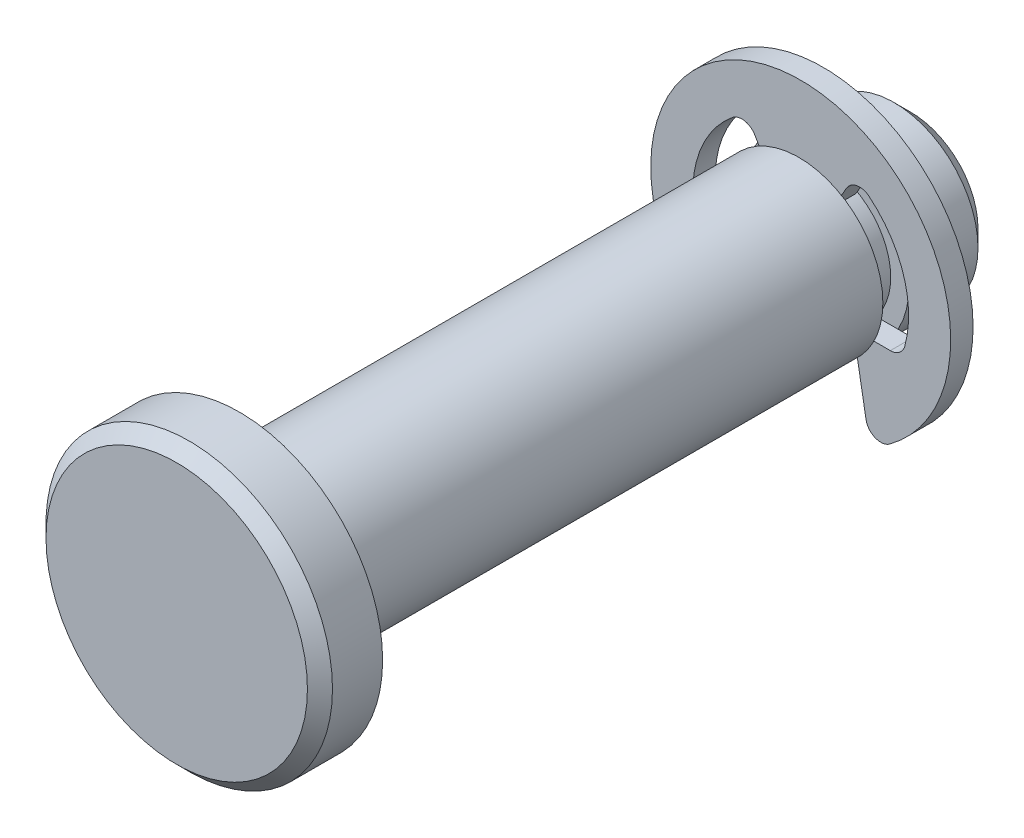
ISO-10303-21;
HEADER;
FILE_DESCRIPTION(('STEP AP214'),'2;1');
FILE_NAME('part.step','',(''),(''),'','','');
FILE_SCHEMA(('AUTOMOTIVE_DESIGN { 1 0 10303 214 1 1 1 1 }'));
ENDSEC;
DATA;
#1=APPLICATION_CONTEXT('core data for automotive mechanical design processes');
#2=APPLICATION_PROTOCOL_DEFINITION('international standard','automotive_design',2000,#1);
#3=PRODUCT_CONTEXT('',#1,'mechanical');
#4=PRODUCT('Part','Part','',(#3));
#5=PRODUCT_RELATED_PRODUCT_CATEGORY('part','',(#4));
#6=PRODUCT_DEFINITION_FORMATION('','',#4);
#7=PRODUCT_DEFINITION_CONTEXT('part definition',#1,'design');
#8=PRODUCT_DEFINITION('design','',#6,#7);
#9=PRODUCT_DEFINITION_SHAPE('','',#8);
#10=(LENGTH_UNIT() NAMED_UNIT(*) SI_UNIT(.MILLI.,.METRE.));
#11=(NAMED_UNIT(*) PLANE_ANGLE_UNIT() SI_UNIT($,.RADIAN.));
#12=(NAMED_UNIT(*) SI_UNIT($,.STERADIAN.) SOLID_ANGLE_UNIT());
#13=UNCERTAINTY_MEASURE_WITH_UNIT(LENGTH_MEASURE(1.E-05),#10,'distance_accuracy_value','');
#14=(GEOMETRIC_REPRESENTATION_CONTEXT(3) GLOBAL_UNCERTAINTY_ASSIGNED_CONTEXT((#13)) GLOBAL_UNIT_ASSIGNED_CONTEXT((#10,
#11,#12)) REPRESENTATION_CONTEXT('',''));
#15=CARTESIAN_POINT('',(0.,0.,0.));
#16=DIRECTION('',(0.,0.,1.));
#17=DIRECTION('',(1.,0.,0.));
#18=AXIS2_PLACEMENT_3D('',#15,#16,#17);
#19=CARTESIAN_POINT('',(0.,0.,-6.4008));
#20=DIRECTION('',(0.,0.,1.));
#21=DIRECTION('',(1.,0.,0.));
#22=AXIS2_PLACEMENT_3D('',#19,#20,#21);
#23=PLANE('',#22);
#24=DIRECTION('',(-0.173648177666931,0.984807753012208,0.));
#25=VECTOR('',#24,1.);
#26=CARTESIAN_POINT('',(1.25692963982568,0.22163060835344,-6.4008));
#27=LINE('',#26,#25);
#28=CARTESIAN_POINT('',(1.85256069501915,-3.15636096616503,-6.4008));
#29=VERTEX_POINT('',#28);
#30=CARTESIAN_POINT('',(1.49352,-1.12014,-6.4008));
#31=VERTEX_POINT('',#30);
#32=EDGE_CURVE('E202',#29,#31,#27,.T.);
#33=ORIENTED_EDGE('',*,*,#32,.F.);
#34=CARTESIAN_POINT('',(2.2715471535382,-3.08248234897663,-6.4008));
#35=DIRECTION('',(0.,0.,1.));
#36=DIRECTION('',(1.,0.,0.));
#37=AXIS2_PLACEMENT_3D('',#34,#35,#36);
#38=CIRCLE('',#37,0.42545);
#39=CARTESIAN_POINT('',(2.52394128170911,-3.42498038775182,-6.4008));
#40=VERTEX_POINT('',#39);
#41=EDGE_CURVE('E256',#29,#40,#38,.T.);
#42=ORIENTED_EDGE('',*,*,#41,.T.);
#43=CARTESIAN_POINT('',(0.,0.,-6.4008));
#44=DIRECTION('',(0.,0.,1.));
#45=DIRECTION('',(1.,0.,0.));
#46=AXIS2_PLACEMENT_3D('',#43,#44,#45);
#47=CIRCLE('',#46,4.2545);
#48=CARTESIAN_POINT('',(-2.52394128170911,-3.42498038775182,-6.4008));
#49=VERTEX_POINT('',#48);
#50=EDGE_CURVE('E182',#40,#49,#47,.T.);
#51=ORIENTED_EDGE('',*,*,#50,.T.);
#52=CARTESIAN_POINT('',(-2.2715471535382,-3.08248234897663,-6.4008));
#53=DIRECTION('',(0.,0.,1.));
#54=DIRECTION('',(1.,0.,0.));
#55=AXIS2_PLACEMENT_3D('',#52,#53,#54);
#56=CIRCLE('',#55,0.42545);
#57=CARTESIAN_POINT('',(-1.85256069501915,-3.15636096616503,-6.4008));
#58=VERTEX_POINT('',#57);
#59=EDGE_CURVE('E254',#49,#58,#56,.T.);
#60=ORIENTED_EDGE('',*,*,#59,.T.);
#61=DIRECTION('',(-0.173648177666931,-0.984807753012208,0.));
#62=VECTOR('',#61,1.);
#63=CARTESIAN_POINT('',(-1.25692963982568,0.22163060835344,-6.4008));
#64=LINE('',#63,#62);
#65=CARTESIAN_POINT('',(-1.49352,-1.12014,-6.4008));
#66=VERTEX_POINT('',#65);
#67=EDGE_CURVE('E198',#66,#58,#64,.T.);
#68=ORIENTED_EDGE('',*,*,#67,.F.);
#69=DIRECTION('',(1.,0.,0.));
#70=VECTOR('',#69,1.);
#71=CARTESIAN_POINT('',(0.,-1.12014,-6.4008));
#72=LINE('',#71,#70);
#73=CARTESIAN_POINT('',(-2.54203626378539,-1.12014,-6.4008));
#74=VERTEX_POINT('',#73);
#75=EDGE_CURVE('E189',#74,#66,#72,.T.);
#76=ORIENTED_EDGE('',*,*,#75,.F.);
#77=CARTESIAN_POINT('',(-2.54203626378539,-0.69469,-6.4008));
#78=DIRECTION('',(0.,0.,1.));
#79=DIRECTION('',(1.,0.,0.));
#80=AXIS2_PLACEMENT_3D('',#77,#78,#79);
#81=CIRCLE('',#80,0.42545);
#82=CARTESIAN_POINT('',(-2.95243729914352,-0.806844771084337,-6.4008));
#83=VERTEX_POINT('',#82);
#84=EDGE_CURVE('E54',#74,#83,#81,.F.);
#85=ORIENTED_EDGE('',*,*,#84,.T.);
#86=CARTESIAN_POINT('',(0.,0.,-6.4008));
#87=DIRECTION('',(0.,0.,1.));
#88=DIRECTION('',(1.,0.,0.));
#89=AXIS2_PLACEMENT_3D('',#86,#87,#88);
#90=CIRCLE('',#89,3.0607);
#91=CARTESIAN_POINT('',(-1.93820951958955,2.36880314677528,-6.4008));
#92=VERTEX_POINT('',#91);
#93=EDGE_CURVE('E214',#92,#83,#90,.T.);
#94=ORIENTED_EDGE('',*,*,#93,.F.);
#95=CARTESIAN_POINT('',(-1.66879035400345,2.03952968031481,-6.4008));
#96=DIRECTION('',(0.,0.,1.));
#97=DIRECTION('',(1.,0.,0.));
#98=AXIS2_PLACEMENT_3D('',#95,#96,#97);
#99=CIRCLE('',#98,0.42545);
#100=CARTESIAN_POINT('',(-1.30033984596336,2.25225468031482,-6.4008));
#101=VERTEX_POINT('',#100);
#102=EDGE_CURVE('E186',#92,#101,#99,.F.);
#103=ORIENTED_EDGE('',*,*,#102,.T.);
#104=DIRECTION('',(-0.500000000000002,0.866025403784438,0.));
#105=VECTOR('',#104,1.);
#106=CARTESIAN_POINT('',(0.,0.,-6.4008));
#107=LINE('',#106,#105);
#108=CARTESIAN_POINT('',(-0.933450000000003,1.61678282632517,-6.4008));
#109=VERTEX_POINT('',#108);
#110=EDGE_CURVE('E178',#109,#101,#107,.T.);
#111=ORIENTED_EDGE('',*,*,#110,.F.);
#112=DIRECTION('',(1.,0.,0.));
#113=VECTOR('',#112,1.);
#114=CARTESIAN_POINT('',(-0.933450000000003,1.61678282632517,-6.4008));
#115=LINE('',#114,#113);
#116=CARTESIAN_POINT('',(0.933450000000003,1.61678282632517,-6.4008));
#117=VERTEX_POINT('',#116);
#118=EDGE_CURVE('E162',#109,#117,#115,.T.);
#119=ORIENTED_EDGE('',*,*,#118,.T.);
#120=DIRECTION('',(-0.500000000000002,-0.866025403784438,0.));
#121=VECTOR('',#120,1.);
#122=CARTESIAN_POINT('',(0.,0.,-6.4008));
#123=LINE('',#122,#121);
#124=CARTESIAN_POINT('',(1.30033984596336,2.25225468031482,-6.4008));
#125=VERTEX_POINT('',#124);
#126=EDGE_CURVE('E212',#125,#117,#123,.T.);
#127=ORIENTED_EDGE('',*,*,#126,.F.);
#128=CARTESIAN_POINT('',(1.66879035400345,2.03952968031481,-6.4008));
#129=DIRECTION('',(0.,0.,1.));
#130=DIRECTION('',(1.,0.,0.));
#131=AXIS2_PLACEMENT_3D('',#128,#129,#130);
#132=CIRCLE('',#131,0.42545);
#133=CARTESIAN_POINT('',(1.93820951958955,2.36880314677528,-6.4008));
#134=VERTEX_POINT('',#133);
#135=EDGE_CURVE('E271',#125,#134,#132,.F.);
#136=ORIENTED_EDGE('',*,*,#135,.T.);
#137=CARTESIAN_POINT('',(0.,0.,-6.4008));
#138=DIRECTION('',(0.,0.,1.));
#139=DIRECTION('',(1.,0.,0.));
#140=AXIS2_PLACEMENT_3D('',#137,#138,#139);
#141=CIRCLE('',#140,3.0607);
#142=CARTESIAN_POINT('',(2.95243729914352,-0.806844771084337,-6.4008));
#143=VERTEX_POINT('',#142);
#144=EDGE_CURVE('E217',#143,#134,#141,.T.);
#145=ORIENTED_EDGE('',*,*,#144,.F.);
#146=CARTESIAN_POINT('',(2.54203626378539,-0.69469,-6.4008));
#147=DIRECTION('',(0.,0.,1.));
#148=DIRECTION('',(1.,0.,0.));
#149=AXIS2_PLACEMENT_3D('',#146,#147,#148);
#150=CIRCLE('',#149,0.42545);
#151=CARTESIAN_POINT('',(2.54203626378539,-1.12014,-6.4008));
#152=VERTEX_POINT('',#151);
#153=EDGE_CURVE('E267',#143,#152,#150,.F.);
#154=ORIENTED_EDGE('',*,*,#153,.T.);
#155=DIRECTION('',(1.,0.,0.));
#156=VECTOR('',#155,1.);
#157=CARTESIAN_POINT('',(0.,-1.12014,-6.4008));
#158=LINE('',#157,#156);
#159=EDGE_CURVE('E207',#31,#152,#158,.T.);
#160=ORIENTED_EDGE('',*,*,#159,.F.);
#161=EDGE_LOOP('',(#33,#42,#51,#60,#68,#76,#85,#94,#103,#111,#119,#127,#136,#145,#154,#160));
#162=FACE_BOUND('',#161,.T.);
#163=ADVANCED_FACE('F46',(#162),#23,.T.);
#164=CARTESIAN_POINT('',(0.,0.,-7.0358));
#165=DIRECTION('',(0.,0.,1.));
#166=DIRECTION('',(1.,0.,0.));
#167=AXIS2_PLACEMENT_3D('',#164,#165,#166);
#168=PLANE('',#167);
#169=CARTESIAN_POINT('',(0.,0.,-7.0358));
#170=DIRECTION('',(0.,0.,1.));
#171=DIRECTION('',(1.,0.,0.));
#172=AXIS2_PLACEMENT_3D('',#169,#170,#171);
#173=CIRCLE('',#172,4.2545);
#174=CARTESIAN_POINT('',(2.52394128170911,-3.42498038775182,-7.0358));
#175=VERTEX_POINT('',#174);
#176=CARTESIAN_POINT('',(-2.52394128170911,-3.42498038775182,-7.0358));
#177=VERTEX_POINT('',#176);
#178=EDGE_CURVE('E220',#175,#177,#173,.T.);
#179=ORIENTED_EDGE('',*,*,#178,.F.);
#180=CARTESIAN_POINT('',(2.2715471535382,-3.08248234897663,-7.0358));
#181=DIRECTION('',(0.,0.,1.));
#182=DIRECTION('',(1.,0.,0.));
#183=AXIS2_PLACEMENT_3D('',#180,#181,#182);
#184=CIRCLE('',#183,0.42545);
#185=CARTESIAN_POINT('',(1.85256069501915,-3.15636096616503,-7.0358));
#186=VERTEX_POINT('',#185);
#187=EDGE_CURVE('E264',#175,#186,#184,.F.);
#188=ORIENTED_EDGE('',*,*,#187,.T.);
#189=DIRECTION('',(-0.173648177666931,0.984807753012208,0.));
#190=VECTOR('',#189,1.);
#191=CARTESIAN_POINT('',(1.25692963982568,0.22163060835344,-7.0358));
#192=LINE('',#191,#190);
#193=CARTESIAN_POINT('',(1.49352,-1.12014,-7.0358));
#194=VERTEX_POINT('',#193);
#195=EDGE_CURVE('E200',#186,#194,#192,.T.);
#196=ORIENTED_EDGE('',*,*,#195,.T.);
#197=DIRECTION('',(1.,0.,0.));
#198=VECTOR('',#197,1.);
#199=CARTESIAN_POINT('',(0.,-1.12014,-7.0358));
#200=LINE('',#199,#198);
#201=CARTESIAN_POINT('',(2.54203626378539,-1.12014,-7.0358));
#202=VERTEX_POINT('',#201);
#203=EDGE_CURVE('E204',#194,#202,#200,.T.);
#204=ORIENTED_EDGE('',*,*,#203,.T.);
#205=CARTESIAN_POINT('',(2.54203626378539,-0.69469,-7.0358));
#206=DIRECTION('',(0.,0.,1.));
#207=DIRECTION('',(1.,0.,0.));
#208=AXIS2_PLACEMENT_3D('',#205,#206,#207);
#209=CIRCLE('',#208,0.42545);
#210=CARTESIAN_POINT('',(2.95243729914352,-0.806844771084337,-7.0358));
#211=VERTEX_POINT('',#210);
#212=EDGE_CURVE('E269',#202,#211,#209,.T.);
#213=ORIENTED_EDGE('',*,*,#212,.T.);
#214=CARTESIAN_POINT('',(0.,0.,-7.0358));
#215=DIRECTION('',(0.,0.,1.));
#216=DIRECTION('',(1.,0.,0.));
#217=AXIS2_PLACEMENT_3D('',#214,#215,#216);
#218=CIRCLE('',#217,3.0607);
#219=CARTESIAN_POINT('',(1.93820951958955,2.36880314677528,-7.0358));
#220=VERTEX_POINT('',#219);
#221=EDGE_CURVE('E228',#211,#220,#218,.T.);
#222=ORIENTED_EDGE('',*,*,#221,.T.);
#223=CARTESIAN_POINT('',(1.66879035400345,2.03952968031481,-7.0358));
#224=DIRECTION('',(0.,0.,1.));
#225=DIRECTION('',(1.,0.,0.));
#226=AXIS2_PLACEMENT_3D('',#223,#224,#225);
#227=CIRCLE('',#226,0.42545);
#228=CARTESIAN_POINT('',(1.30033984596336,2.25225468031482,-7.0358));
#229=VERTEX_POINT('',#228);
#230=EDGE_CURVE('E273',#220,#229,#227,.T.);
#231=ORIENTED_EDGE('',*,*,#230,.T.);
#232=DIRECTION('',(-0.500000000000002,-0.866025403784438,0.));
#233=VECTOR('',#232,1.);
#234=CARTESIAN_POINT('',(0.,0.,-7.0358));
#235=LINE('',#234,#233);
#236=CARTESIAN_POINT('',(0.933450000000003,1.61678282632517,-7.0358));
#237=VERTEX_POINT('',#236);
#238=EDGE_CURVE('E210',#229,#237,#235,.T.);
#239=ORIENTED_EDGE('',*,*,#238,.T.);
#240=DIRECTION('',(-1.,0.,0.));
#241=VECTOR('',#240,1.);
#242=CARTESIAN_POINT('',(-0.933450000000003,1.61678282632517,-7.0358));
#243=LINE('',#242,#241);
#244=CARTESIAN_POINT('',(-0.933450000000003,1.61678282632517,-7.0358));
#245=VERTEX_POINT('',#244);
#246=EDGE_CURVE('E173',#237,#245,#243,.T.);
#247=ORIENTED_EDGE('',*,*,#246,.T.);
#248=DIRECTION('',(-0.500000000000002,0.866025403784438,0.));
#249=VECTOR('',#248,1.);
#250=CARTESIAN_POINT('',(0.,0.,-7.0358));
#251=LINE('',#250,#249);
#252=CARTESIAN_POINT('',(-1.30033984596336,2.25225468031482,-7.0358));
#253=VERTEX_POINT('',#252);
#254=EDGE_CURVE('E181',#245,#253,#251,.T.);
#255=ORIENTED_EDGE('',*,*,#254,.T.);
#256=CARTESIAN_POINT('',(-1.66879035400345,2.03952968031481,-7.0358));
#257=DIRECTION('',(0.,0.,1.));
#258=DIRECTION('',(1.,0.,0.));
#259=AXIS2_PLACEMENT_3D('',#256,#257,#258);
#260=CIRCLE('',#259,0.42545);
#261=CARTESIAN_POINT('',(-1.93820951958955,2.36880314677528,-7.0358));
#262=VERTEX_POINT('',#261);
#263=EDGE_CURVE('E276',#253,#262,#260,.T.);
#264=ORIENTED_EDGE('',*,*,#263,.T.);
#265=CARTESIAN_POINT('',(0.,0.,-7.0358));
#266=DIRECTION('',(0.,0.,1.));
#267=DIRECTION('',(1.,0.,0.));
#268=AXIS2_PLACEMENT_3D('',#265,#266,#267);
#269=CIRCLE('',#268,3.0607);
#270=CARTESIAN_POINT('',(-2.95243729914352,-0.806844771084337,-7.0358));
#271=VERTEX_POINT('',#270);
#272=EDGE_CURVE('E225',#262,#271,#269,.T.);
#273=ORIENTED_EDGE('',*,*,#272,.T.);
#274=CARTESIAN_POINT('',(-2.54203626378539,-0.69469,-7.0358));
#275=DIRECTION('',(0.,0.,1.));
#276=DIRECTION('',(1.,0.,0.));
#277=AXIS2_PLACEMENT_3D('',#274,#275,#276);
#278=CIRCLE('',#277,0.42545);
#279=CARTESIAN_POINT('',(-2.54203626378539,-1.12014,-7.0358));
#280=VERTEX_POINT('',#279);
#281=EDGE_CURVE('E12',#271,#280,#278,.T.);
#282=ORIENTED_EDGE('',*,*,#281,.T.);
#283=DIRECTION('',(1.,0.,0.));
#284=VECTOR('',#283,1.);
#285=CARTESIAN_POINT('',(0.,-1.12014,-7.0358));
#286=LINE('',#285,#284);
#287=CARTESIAN_POINT('',(-1.49352,-1.12014,-7.0358));
#288=VERTEX_POINT('',#287);
#289=EDGE_CURVE('E187',#280,#288,#286,.T.);
#290=ORIENTED_EDGE('',*,*,#289,.T.);
#291=DIRECTION('',(-0.173648177666931,-0.984807753012208,0.));
#292=VECTOR('',#291,1.);
#293=CARTESIAN_POINT('',(-1.25692963982568,0.22163060835344,-7.0358));
#294=LINE('',#293,#292);
#295=CARTESIAN_POINT('',(-1.85256069501915,-3.15636096616503,-7.0358));
#296=VERTEX_POINT('',#295);
#297=EDGE_CURVE('E196',#288,#296,#294,.T.);
#298=ORIENTED_EDGE('',*,*,#297,.T.);
#299=CARTESIAN_POINT('',(-2.2715471535382,-3.08248234897663,-7.0358));
#300=DIRECTION('',(0.,0.,1.));
#301=DIRECTION('',(1.,0.,0.));
#302=AXIS2_PLACEMENT_3D('',#299,#300,#301);
#303=CIRCLE('',#302,0.42545);
#304=EDGE_CURVE('E68',#296,#177,#303,.F.);
#305=ORIENTED_EDGE('',*,*,#304,.T.);
#306=EDGE_LOOP('',(#179,#188,#196,#204,#213,#222,#231,#239,#247,#255,#264,#273,#282,#290,#298,#305));
#307=FACE_BOUND('',#306,.T.);
#308=ADVANCED_FACE('F289',(#307),#168,.F.);
#309=CARTESIAN_POINT('',(0.,0.,-6.4008));
#310=DIRECTION('',(0.,0.,-1.));
#311=DIRECTION('',(-1.,0.,0.));
#312=AXIS2_PLACEMENT_3D('',#309,#310,#311);
#313=CYLINDRICAL_SURFACE('',#312,4.2545);
#314=ORIENTED_EDGE('',*,*,#50,.F.);
#315=DIRECTION('',(0.,0.,-1.));
#316=VECTOR('',#315,1.);
#317=CARTESIAN_POINT('',(2.52394128170911,-3.42498038775182,-6.4008));
#318=LINE('',#317,#316);
#319=EDGE_CURVE('E261',#40,#175,#318,.T.);
#320=ORIENTED_EDGE('',*,*,#319,.T.);
#321=ORIENTED_EDGE('',*,*,#178,.T.);
#322=DIRECTION('',(0.,0.,-1.));
#323=VECTOR('',#322,1.);
#324=CARTESIAN_POINT('',(-2.52394128170911,-3.42498038775182,-6.4008));
#325=LINE('',#324,#323);
#326=EDGE_CURVE('E258',#177,#49,#325,.F.);
#327=ORIENTED_EDGE('',*,*,#326,.T.);
#328=EDGE_LOOP('',(#314,#320,#321,#327));
#329=FACE_BOUND('',#328,.T.);
#330=ADVANCED_FACE('F329',(#329),#313,.T.);
#331=CARTESIAN_POINT('',(-1.49352,-1.12014,-9.525));
#332=DIRECTION('',(-0.984807753012208,0.173648177666931,0.));
#333=DIRECTION('',(-0.173648177666931,-0.984807753012208,0.));
#334=AXIS2_PLACEMENT_3D('',#331,#332,#333);
#335=PLANE('',#334);
#336=ORIENTED_EDGE('',*,*,#67,.T.);
#337=DIRECTION('',(0.,0.,-1.));
#338=VECTOR('',#337,1.);
#339=CARTESIAN_POINT('',(-1.85256069501915,-3.15636096616503,-9.525));
#340=LINE('',#339,#338);
#341=EDGE_CURVE('E61',#58,#296,#340,.T.);
#342=ORIENTED_EDGE('',*,*,#341,.T.);
#343=ORIENTED_EDGE('',*,*,#297,.F.);
#344=DIRECTION('',(0.,0.,1.));
#345=VECTOR('',#344,1.);
#346=CARTESIAN_POINT('',(-1.49352,-1.12014,-9.525));
#347=LINE('',#346,#345);
#348=EDGE_CURVE('E294',#288,#66,#347,.T.);
#349=ORIENTED_EDGE('',*,*,#348,.T.);
#350=EDGE_LOOP('',(#336,#342,#343,#349));
#351=FACE_BOUND('',#350,.T.);
#352=ADVANCED_FACE('F334',(#351),#335,.F.);
#353=CARTESIAN_POINT('',(-1.53035,2.65064395336303,-9.525));
#354=DIRECTION('',(0.866025403784438,0.500000000000002,0.));
#355=DIRECTION('',(-0.500000000000002,0.866025403784438,0.));
#356=AXIS2_PLACEMENT_3D('',#353,#354,#355);
#357=PLANE('',#356);
#358=ORIENTED_EDGE('',*,*,#110,.T.);
#359=DIRECTION('',(0.,0.,-1.));
#360=VECTOR('',#359,1.);
#361=CARTESIAN_POINT('',(-1.30033984596336,2.25225468031481,-7.03580000000001));
#362=LINE('',#361,#360);
#363=EDGE_CURVE('E246',#101,#253,#362,.T.);
#364=ORIENTED_EDGE('',*,*,#363,.T.);
#365=ORIENTED_EDGE('',*,*,#254,.F.);
#366=DIRECTION('',(0.,0.,-1.));
#367=VECTOR('',#366,1.);
#368=CARTESIAN_POINT('',(-0.933450000000003,1.61678282632517,-6.4008));
#369=LINE('',#368,#367);
#370=EDGE_CURVE('E166',#245,#109,#369,.F.);
#371=ORIENTED_EDGE('',*,*,#370,.T.);
#372=EDGE_LOOP('',(#358,#364,#365,#371));
#373=FACE_BOUND('',#372,.T.);
#374=ADVANCED_FACE('F177',(#373),#357,.F.);
#375=CARTESIAN_POINT('',(0.,0.,-9.525));
#376=DIRECTION('',(0.,0.,1.));
#377=DIRECTION('',(1.,0.,0.));
#378=AXIS2_PLACEMENT_3D('',#375,#376,#377);
#379=CYLINDRICAL_SURFACE('',#378,3.0607);
#380=ORIENTED_EDGE('',*,*,#272,.F.);
#381=DIRECTION('',(0.,0.,1.));
#382=VECTOR('',#381,1.);
#383=CARTESIAN_POINT('',(-1.93820951958955,2.36880314677528,-9.525));
#384=LINE('',#383,#382);
#385=EDGE_CURVE('E243',#262,#92,#384,.T.);
#386=ORIENTED_EDGE('',*,*,#385,.T.);
#387=ORIENTED_EDGE('',*,*,#93,.T.);
#388=DIRECTION('',(0.,0.,1.));
#389=VECTOR('',#388,1.);
#390=CARTESIAN_POINT('',(-2.95243729914352,-0.806844771084337,-9.525));
#391=LINE('',#390,#389);
#392=EDGE_CURVE('E241',#83,#271,#391,.F.);
#393=ORIENTED_EDGE('',*,*,#392,.T.);
#394=EDGE_LOOP('',(#380,#386,#387,#393));
#395=FACE_BOUND('',#394,.T.);
#396=ADVANCED_FACE('F284',(#395),#379,.F.);
#397=CARTESIAN_POINT('',(-2.84836284036989,-1.12014,-9.525));
#398=DIRECTION('',(0.,-1.,0.));
#399=DIRECTION('',(0.,0.,-1.));
#400=AXIS2_PLACEMENT_3D('',#397,#398,#399);
#401=PLANE('',#400);
#402=ORIENTED_EDGE('',*,*,#289,.F.);
#403=DIRECTION('',(0.,0.,-1.));
#404=VECTOR('',#403,1.);
#405=CARTESIAN_POINT('',(-2.54203626378539,-1.12014,-6.4008));
#406=LINE('',#405,#404);
#407=EDGE_CURVE('E248',#280,#74,#406,.F.);
#408=ORIENTED_EDGE('',*,*,#407,.T.);
#409=ORIENTED_EDGE('',*,*,#75,.T.);
#410=ORIENTED_EDGE('',*,*,#348,.F.);
#411=EDGE_LOOP('',(#402,#408,#409,#410));
#412=FACE_BOUND('',#411,.T.);
#413=ADVANCED_FACE('F292',(#412),#401,.F.);
#414=CARTESIAN_POINT('',(0.,0.,-9.525));
#415=DIRECTION('',(0.,0.,1.));
#416=DIRECTION('',(1.,0.,0.));
#417=AXIS2_PLACEMENT_3D('',#414,#415,#416);
#418=CYLINDRICAL_SURFACE('',#417,3.0607);
#419=ORIENTED_EDGE('',*,*,#221,.F.);
#420=DIRECTION('',(0.,0.,1.));
#421=VECTOR('',#420,1.);
#422=CARTESIAN_POINT('',(2.95243729914352,-0.806844771084337,-9.525));
#423=LINE('',#422,#421);
#424=EDGE_CURVE('E233',#211,#143,#423,.T.);
#425=ORIENTED_EDGE('',*,*,#424,.T.);
#426=ORIENTED_EDGE('',*,*,#144,.T.);
#427=DIRECTION('',(0.,0.,1.));
#428=VECTOR('',#427,1.);
#429=CARTESIAN_POINT('',(1.93820951958955,2.36880314677528,-9.525));
#430=LINE('',#429,#428);
#431=EDGE_CURVE('E231',#134,#220,#430,.F.);
#432=ORIENTED_EDGE('',*,*,#431,.T.);
#433=EDGE_LOOP('',(#419,#425,#426,#432));
#434=FACE_BOUND('',#433,.T.);
#435=ADVANCED_FACE('F308',(#434),#418,.F.);
#436=CARTESIAN_POINT('',(1.49352,-1.12014,-9.525));
#437=DIRECTION('',(0.,-1.,0.));
#438=DIRECTION('',(0.,0.,-1.));
#439=AXIS2_PLACEMENT_3D('',#436,#437,#438);
#440=PLANE('',#439);
#441=ORIENTED_EDGE('',*,*,#159,.T.);
#442=DIRECTION('',(0.,0.,-1.));
#443=VECTOR('',#442,1.);
#444=CARTESIAN_POINT('',(2.54203626378539,-1.12014,-7.03580000000001));
#445=LINE('',#444,#443);
#446=EDGE_CURVE('E236',#152,#202,#445,.T.);
#447=ORIENTED_EDGE('',*,*,#446,.T.);
#448=ORIENTED_EDGE('',*,*,#203,.F.);
#449=DIRECTION('',(0.,0.,1.));
#450=VECTOR('',#449,1.);
#451=CARTESIAN_POINT('',(1.49352,-1.12014,-9.525));
#452=LINE('',#451,#450);
#453=EDGE_CURVE('E191',#194,#31,#452,.T.);
#454=ORIENTED_EDGE('',*,*,#453,.T.);
#455=EDGE_LOOP('',(#441,#447,#448,#454));
#456=FACE_BOUND('',#455,.T.);
#457=ADVANCED_FACE('F318',(#456),#440,.F.);
#458=CARTESIAN_POINT('',(1.49352,-1.12014,-9.525));
#459=DIRECTION('',(0.984807753012208,0.173648177666931,0.));
#460=DIRECTION('',(-0.173648177666931,0.984807753012208,0.));
#461=AXIS2_PLACEMENT_3D('',#458,#459,#460);
#462=PLANE('',#461);
#463=ORIENTED_EDGE('',*,*,#195,.F.);
#464=DIRECTION('',(0.,0.,-1.));
#465=VECTOR('',#464,1.);
#466=CARTESIAN_POINT('',(1.85256069501915,-3.15636096616503,-9.525));
#467=LINE('',#466,#465);
#468=EDGE_CURVE('E251',#186,#29,#467,.F.);
#469=ORIENTED_EDGE('',*,*,#468,.T.);
#470=ORIENTED_EDGE('',*,*,#32,.T.);
#471=ORIENTED_EDGE('',*,*,#453,.F.);
#472=EDGE_LOOP('',(#463,#469,#470,#471));
#473=FACE_BOUND('',#472,.T.);
#474=ADVANCED_FACE('F323',(#473),#462,.F.);
#475=CARTESIAN_POINT('',(0.,0.,-9.525));
#476=DIRECTION('',(-0.866025403784438,0.500000000000002,0.));
#477=DIRECTION('',(-0.500000000000002,-0.866025403784438,0.));
#478=AXIS2_PLACEMENT_3D('',#475,#476,#477);
#479=PLANE('',#478);
#480=ORIENTED_EDGE('',*,*,#238,.F.);
#481=DIRECTION('',(0.,0.,-1.));
#482=VECTOR('',#481,1.);
#483=CARTESIAN_POINT('',(1.30033984596336,2.25225468031481,-6.4008));
#484=LINE('',#483,#482);
#485=EDGE_CURVE('E238',#229,#125,#484,.F.);
#486=ORIENTED_EDGE('',*,*,#485,.T.);
#487=ORIENTED_EDGE('',*,*,#126,.T.);
#488=DIRECTION('',(0.,0.,-1.));
#489=VECTOR('',#488,1.);
#490=CARTESIAN_POINT('',(0.933450000000003,1.61678282632517,-6.4008));
#491=LINE('',#490,#489);
#492=EDGE_CURVE('E169',#117,#237,#491,.T.);
#493=ORIENTED_EDGE('',*,*,#492,.T.);
#494=EDGE_LOOP('',(#480,#486,#487,#493));
#495=FACE_BOUND('',#494,.T.);
#496=ADVANCED_FACE('F301',(#495),#479,.F.);
#497=CARTESIAN_POINT('',(-0.933450000000003,1.61678282632517,-8.91938015772282));
#498=DIRECTION('',(0.,-1.,0.));
#499=DIRECTION('',(0.,0.,-1.));
#500=AXIS2_PLACEMENT_3D('',#497,#498,#499);
#501=PLANE('',#500);
#502=ORIENTED_EDGE('',*,*,#246,.F.);
#503=ORIENTED_EDGE('',*,*,#492,.F.);
#504=ORIENTED_EDGE('',*,*,#118,.F.);
#505=ORIENTED_EDGE('',*,*,#370,.F.);
#506=EDGE_LOOP('',(#502,#503,#504,#505));
#507=FACE_BOUND('',#506,.T.);
#508=ADVANCED_FACE('F165',(#507),#501,.T.);
#509=CARTESIAN_POINT('',(2.54203626378539,-0.69469,-9.525));
#510=DIRECTION('',(0.,0.,1.));
#511=DIRECTION('',(1.,0.,0.));
#512=AXIS2_PLACEMENT_3D('',#509,#510,#511);
#513=CYLINDRICAL_SURFACE('',#512,0.42545);
#514=ORIENTED_EDGE('',*,*,#212,.F.);
#515=ORIENTED_EDGE('',*,*,#446,.F.);
#516=ORIENTED_EDGE('',*,*,#153,.F.);
#517=ORIENTED_EDGE('',*,*,#424,.F.);
#518=EDGE_LOOP('',(#514,#515,#516,#517));
#519=FACE_BOUND('',#518,.T.);
#520=ADVANCED_FACE('F314',(#519),#513,.F.);
#521=CARTESIAN_POINT('',(1.66879035400345,2.03952968031481,-9.525));
#522=DIRECTION('',(0.,0.,1.));
#523=DIRECTION('',(1.,0.,0.));
#524=AXIS2_PLACEMENT_3D('',#521,#522,#523);
#525=CYLINDRICAL_SURFACE('',#524,0.42545);
#526=ORIENTED_EDGE('',*,*,#230,.F.);
#527=ORIENTED_EDGE('',*,*,#431,.F.);
#528=ORIENTED_EDGE('',*,*,#135,.F.);
#529=ORIENTED_EDGE('',*,*,#485,.F.);
#530=EDGE_LOOP('',(#526,#527,#528,#529));
#531=FACE_BOUND('',#530,.T.);
#532=ADVANCED_FACE('F311',(#531),#525,.F.);
#533=CARTESIAN_POINT('',(-1.66879035400345,2.03952968031481,-9.525));
#534=DIRECTION('',(0.,0.,1.));
#535=DIRECTION('',(1.,0.,0.));
#536=AXIS2_PLACEMENT_3D('',#533,#534,#535);
#537=CYLINDRICAL_SURFACE('',#536,0.42545);
#538=ORIENTED_EDGE('',*,*,#263,.F.);
#539=ORIENTED_EDGE('',*,*,#363,.F.);
#540=ORIENTED_EDGE('',*,*,#102,.F.);
#541=ORIENTED_EDGE('',*,*,#385,.F.);
#542=EDGE_LOOP('',(#538,#539,#540,#541));
#543=FACE_BOUND('',#542,.T.);
#544=ADVANCED_FACE('F357',(#543),#537,.F.);
#545=CARTESIAN_POINT('',(-2.54203626378539,-0.69469,-9.525));
#546=DIRECTION('',(0.,0.,1.));
#547=DIRECTION('',(1.,0.,0.));
#548=AXIS2_PLACEMENT_3D('',#545,#546,#547);
#549=CYLINDRICAL_SURFACE('',#548,0.42545);
#550=ORIENTED_EDGE('',*,*,#281,.F.);
#551=ORIENTED_EDGE('',*,*,#392,.F.);
#552=ORIENTED_EDGE('',*,*,#84,.F.);
#553=ORIENTED_EDGE('',*,*,#407,.F.);
#554=EDGE_LOOP('',(#550,#551,#552,#553));
#555=FACE_BOUND('',#554,.T.);
#556=ADVANCED_FACE('F287',(#555),#549,.F.);
#557=CARTESIAN_POINT('',(2.2715471535382,-3.08248234897663,-6.4008));
#558=DIRECTION('',(0.,0.,-1.));
#559=DIRECTION('',(-1.,0.,0.));
#560=AXIS2_PLACEMENT_3D('',#557,#558,#559);
#561=CYLINDRICAL_SURFACE('',#560,0.42545);
#562=ORIENTED_EDGE('',*,*,#187,.F.);
#563=ORIENTED_EDGE('',*,*,#319,.F.);
#564=ORIENTED_EDGE('',*,*,#41,.F.);
#565=ORIENTED_EDGE('',*,*,#468,.F.);
#566=EDGE_LOOP('',(#562,#563,#564,#565));
#567=FACE_BOUND('',#566,.T.);
#568=ADVANCED_FACE('F332',(#567),#561,.T.);
#569=CARTESIAN_POINT('',(-2.2715471535382,-3.08248234897663,-6.4008));
#570=DIRECTION('',(0.,0.,-1.));
#571=DIRECTION('',(-1.,0.,0.));
#572=AXIS2_PLACEMENT_3D('',#569,#570,#571);
#573=CYLINDRICAL_SURFACE('',#572,0.42545);
#574=ORIENTED_EDGE('',*,*,#304,.F.);
#575=ORIENTED_EDGE('',*,*,#341,.F.);
#576=ORIENTED_EDGE('',*,*,#59,.F.);
#577=ORIENTED_EDGE('',*,*,#326,.F.);
#578=EDGE_LOOP('',(#574,#575,#576,#577));
#579=FACE_BOUND('',#578,.T.);
#580=ADVANCED_FACE('F48',(#579),#573,.T.);
#581=CLOSED_SHELL('',(#163,#308,#330,#352,#374,#396,#413,#435,#457,#474,#496,#508,#520,#532,
#544,#556,#568,#580));
#582=MANIFOLD_SOLID_BREP('B2',#581);
#583=CARTESIAN_POINT('',(0.,0.,9.525));
#584=DIRECTION('',(0.,0.,-1.));
#585=DIRECTION('',(-1.,0.,0.));
#586=AXIS2_PLACEMENT_3D('',#583,#584,#585);
#587=CYLINDRICAL_SURFACE('',#586,2.38125);
#588=CARTESIAN_POINT('',(0.,0.,9.525));
#589=DIRECTION('',(0.,0.,1.));
#590=DIRECTION('',(1.,0.,0.));
#591=AXIS2_PLACEMENT_3D('',#588,#589,#590);
#592=CIRCLE('',#591,2.38125);
#593=CARTESIAN_POINT('',(2.38125,0.,9.525));
#594=VERTEX_POINT('',#593);
#595=EDGE_CURVE('E507',#594,#594,#592,.T.);
#596=ORIENTED_EDGE('',*,*,#595,.F.);
#597=EDGE_LOOP('',(#596));
#598=FACE_BOUND('',#597,.T.);
#599=CARTESIAN_POINT('',(0.,0.,-6.35000000000001));
#600=DIRECTION('',(0.,0.,1.));
#601=DIRECTION('',(1.,0.,0.));
#602=AXIS2_PLACEMENT_3D('',#599,#600,#601);
#603=CIRCLE('',#602,2.38125);
#604=CARTESIAN_POINT('',(2.38125,0.,-6.35000000000001));
#605=VERTEX_POINT('',#604);
#606=EDGE_CURVE('E519',#605,#605,#603,.T.);
#607=ORIENTED_EDGE('',*,*,#606,.T.);
#608=EDGE_LOOP('',(#607));
#609=FACE_BOUND('',#608,.T.);
#610=ADVANCED_FACE('F487',(#598,#609),#587,.T.);
#611=CARTESIAN_POINT('',(0.,2.38125,-6.35));
#612=DIRECTION('',(0.,0.,-1.));
#613=DIRECTION('',(-1.,0.,0.));
#614=AXIS2_PLACEMENT_3D('',#611,#612,#613);
#615=PLANE('',#614);
#616=CARTESIAN_POINT('',(0.,0.,-6.35000000000001));
#617=DIRECTION('',(0.,0.,1.));
#618=DIRECTION('',(1.,0.,0.));
#619=AXIS2_PLACEMENT_3D('',#616,#617,#618);
#620=CIRCLE('',#619,1.8669);
#621=CARTESIAN_POINT('',(1.8669,0.,-6.35000000000001));
#622=VERTEX_POINT('',#621);
#623=EDGE_CURVE('E510',#622,#622,#620,.T.);
#624=ORIENTED_EDGE('',*,*,#623,.T.);
#625=EDGE_LOOP('',(#624));
#626=FACE_BOUND('',#625,.T.);
#627=ORIENTED_EDGE('',*,*,#606,.F.);
#628=EDGE_LOOP('',(#627));
#629=FACE_BOUND('',#628,.T.);
#630=ADVANCED_FACE('F537',(#626,#629),#615,.T.);
#631=CARTESIAN_POINT('',(0.,0.,9.525));
#632=DIRECTION('',(0.,0.,1.));
#633=DIRECTION('',(1.,0.,0.));
#634=AXIS2_PLACEMENT_3D('',#631,#632,#633);
#635=CYLINDRICAL_SURFACE('',#634,1.8669);
#636=CARTESIAN_POINT('',(0.,0.,-7.0866));
#637=DIRECTION('',(0.,0.,1.));
#638=DIRECTION('',(1.,0.,0.));
#639=AXIS2_PLACEMENT_3D('',#636,#637,#638);
#640=CIRCLE('',#639,1.8669);
#641=CARTESIAN_POINT('',(1.8669,0.,-7.0866));
#642=VERTEX_POINT('',#641);
#643=EDGE_CURVE('E513',#642,#642,#640,.T.);
#644=ORIENTED_EDGE('',*,*,#643,.T.);
#645=EDGE_LOOP('',(#644));
#646=FACE_BOUND('',#645,.T.);
#647=ORIENTED_EDGE('',*,*,#623,.F.);
#648=EDGE_LOOP('',(#647));
#649=FACE_BOUND('',#648,.T.);
#650=ADVANCED_FACE('F542',(#646,#649),#635,.T.);
#651=CARTESIAN_POINT('',(0.,2.38125,-7.08660000000001));
#652=DIRECTION('',(0.,0.,1.));
#653=DIRECTION('',(1.,0.,0.));
#654=AXIS2_PLACEMENT_3D('',#651,#652,#653);
#655=PLANE('',#654);
#656=CARTESIAN_POINT('',(0.,0.,-7.0866));
#657=DIRECTION('',(0.,0.,1.));
#658=DIRECTION('',(1.,0.,0.));
#659=AXIS2_PLACEMENT_3D('',#656,#657,#658);
#660=CIRCLE('',#659,2.38125);
#661=CARTESIAN_POINT('',(2.38125,0.,-7.0866));
#662=VERTEX_POINT('',#661);
#663=EDGE_CURVE('E516',#662,#662,#660,.T.);
#664=ORIENTED_EDGE('',*,*,#663,.T.);
#665=EDGE_LOOP('',(#664));
#666=FACE_BOUND('',#665,.T.);
#667=ORIENTED_EDGE('',*,*,#643,.F.);
#668=EDGE_LOOP('',(#667));
#669=FACE_BOUND('',#668,.T.);
#670=ADVANCED_FACE('F548',(#666,#669),#655,.T.);
#671=CARTESIAN_POINT('',(0.,0.,-9.525));
#672=DIRECTION('',(0.,0.,1.));
#673=DIRECTION('',(1.,0.,0.));
#674=AXIS2_PLACEMENT_3D('',#671,#672,#673);
#675=PLANE('',#674);
#676=CARTESIAN_POINT('',(0.,0.,-9.525));
#677=DIRECTION('',(0.,0.,1.));
#678=DIRECTION('',(1.,0.,0.));
#679=AXIS2_PLACEMENT_3D('',#676,#677,#678);
#680=CIRCLE('',#679,1.90499999999998);
#681=CARTESIAN_POINT('',(1.90499999999998,0.,-9.525));
#682=VERTEX_POINT('',#681);
#683=EDGE_CURVE('E45',#682,#682,#680,.F.);
#684=ORIENTED_EDGE('',*,*,#683,.T.);
#685=EDGE_LOOP('',(#684));
#686=FACE_BOUND('',#685,.T.);
#687=ADVANCED_FACE('F553',(#686),#675,.F.);
#688=CARTESIAN_POINT('',(0.,0.,-9.04874999999999));
#689=DIRECTION('',(0.,0.,1.));
#690=DIRECTION('',(1.,0.,0.));
#691=AXIS2_PLACEMENT_3D('',#688,#689,#690);
#692=CIRCLE('',#691,2.38125);
#693=CARTESIAN_POINT('',(2.38125,0.,-9.04874999999999));
#694=VERTEX_POINT('',#693);
#695=EDGE_CURVE('E494',#694,#694,#692,.T.);
#696=ORIENTED_EDGE('',*,*,#695,.T.);
#697=EDGE_LOOP('',(#696));
#698=FACE_BOUND('',#697,.T.);
#699=ORIENTED_EDGE('',*,*,#663,.F.);
#700=EDGE_LOOP('',(#699));
#701=FACE_BOUND('',#700,.T.);
#702=ADVANCED_FACE('F531',(#698,#701),#587,.T.);
#703=CARTESIAN_POINT('',(0.,0.,9.525));
#704=DIRECTION('',(0.,0.,1.));
#705=DIRECTION('',(1.,0.,0.));
#706=AXIS2_PLACEMENT_3D('',#703,#704,#705);
#707=PLANE('',#706);
#708=CARTESIAN_POINT('',(0.,0.,9.525));
#709=DIRECTION('',(0.,0.,1.));
#710=DIRECTION('',(1.,0.,0.));
#711=AXIS2_PLACEMENT_3D('',#708,#709,#710);
#712=CIRCLE('',#711,4.064);
#713=CARTESIAN_POINT('',(4.064,0.,9.525));
#714=VERTEX_POINT('',#713);
#715=EDGE_CURVE('E522',#714,#714,#712,.T.);
#716=ORIENTED_EDGE('',*,*,#715,.F.);
#717=EDGE_LOOP('',(#716));
#718=FACE_BOUND('',#717,.T.);
#719=ORIENTED_EDGE('',*,*,#595,.T.);
#720=EDGE_LOOP('',(#719));
#721=FACE_BOUND('',#720,.T.);
#722=ADVANCED_FACE('F528',(#718,#721),#707,.F.);
#723=CARTESIAN_POINT('',(0.,0.,11.303));
#724=DIRECTION('',(0.,0.,-1.));
#725=DIRECTION('',(-1.,0.,0.));
#726=AXIS2_PLACEMENT_3D('',#723,#724,#725);
#727=CYLINDRICAL_SURFACE('',#726,4.064);
#728=CARTESIAN_POINT('',(0.,0.,10.9474));
#729=DIRECTION('',(0.,0.,1.));
#730=DIRECTION('',(1.,0.,0.));
#731=AXIS2_PLACEMENT_3D('',#728,#729,#730);
#732=CIRCLE('',#731,4.064);
#733=CARTESIAN_POINT('',(4.064,0.,10.9474));
#734=VERTEX_POINT('',#733);
#735=EDGE_CURVE('E498',#734,#734,#732,.F.);
#736=ORIENTED_EDGE('',*,*,#735,.T.);
#737=EDGE_LOOP('',(#736));
#738=FACE_BOUND('',#737,.T.);
#739=ORIENTED_EDGE('',*,*,#715,.T.);
#740=EDGE_LOOP('',(#739));
#741=FACE_BOUND('',#740,.T.);
#742=ADVANCED_FACE('F526',(#738,#741),#727,.T.);
#743=CARTESIAN_POINT('',(0.,0.,11.303));
#744=DIRECTION('',(0.,0.,1.));
#745=DIRECTION('',(1.,0.,0.));
#746=AXIS2_PLACEMENT_3D('',#743,#744,#745);
#747=PLANE('',#746);
#748=CARTESIAN_POINT('',(0.,0.,11.303));
#749=DIRECTION('',(0.,0.,1.));
#750=DIRECTION('',(1.,0.,0.));
#751=AXIS2_PLACEMENT_3D('',#748,#749,#750);
#752=CIRCLE('',#751,3.7084);
#753=CARTESIAN_POINT('',(3.7084,0.,11.303));
#754=VERTEX_POINT('',#753);
#755=EDGE_CURVE('E502',#754,#754,#752,.T.);
#756=ORIENTED_EDGE('',*,*,#755,.T.);
#757=EDGE_LOOP('',(#756));
#758=FACE_BOUND('',#757,.T.);
#759=ADVANCED_FACE('F557',(#758),#747,.T.);
#760=CARTESIAN_POINT('',(0.,0.,11.303));
#761=DIRECTION('',(0.,0.,-1.));
#762=DIRECTION('',(-1.,0.,0.));
#763=AXIS2_PLACEMENT_3D('',#760,#761,#762);
#764=CONICAL_SURFACE('',#763,3.7084,0.785398163397443);
#765=ORIENTED_EDGE('',*,*,#735,.F.);
#766=EDGE_LOOP('',(#765));
#767=FACE_BOUND('',#766,.T.);
#768=ORIENTED_EDGE('',*,*,#755,.F.);
#769=EDGE_LOOP('',(#768));
#770=FACE_BOUND('',#769,.T.);
#771=ADVANCED_FACE('F555',(#767,#770),#764,.T.);
#772=CARTESIAN_POINT('',(0.,0.,-9.04874999999999));
#773=DIRECTION('',(0.,0.,1.));
#774=DIRECTION('',(1.,0.,0.));
#775=AXIS2_PLACEMENT_3D('',#772,#773,#774);
#776=CONICAL_SURFACE('',#775,2.38125,0.785398163397451);
#777=ORIENTED_EDGE('',*,*,#683,.F.);
#778=EDGE_LOOP('',(#777));
#779=FACE_BOUND('',#778,.T.);
#780=ORIENTED_EDGE('',*,*,#695,.F.);
#781=EDGE_LOOP('',(#780));
#782=FACE_BOUND('',#781,.T.);
#783=ADVANCED_FACE('F489',(#779,#782),#776,.T.);
#784=CLOSED_SHELL('',(#610,#630,#650,#670,#687,#702,#722,#742,#759,#771,#783));
#785=MANIFOLD_SOLID_BREP('B6',#784);
#786=ADVANCED_BREP_SHAPE_REPRESENTATION('',(#18,#582,#785),#14);
#787=SHAPE_DEFINITION_REPRESENTATION(#9,#786);
ENDSEC;
END-ISO-10303-21;
